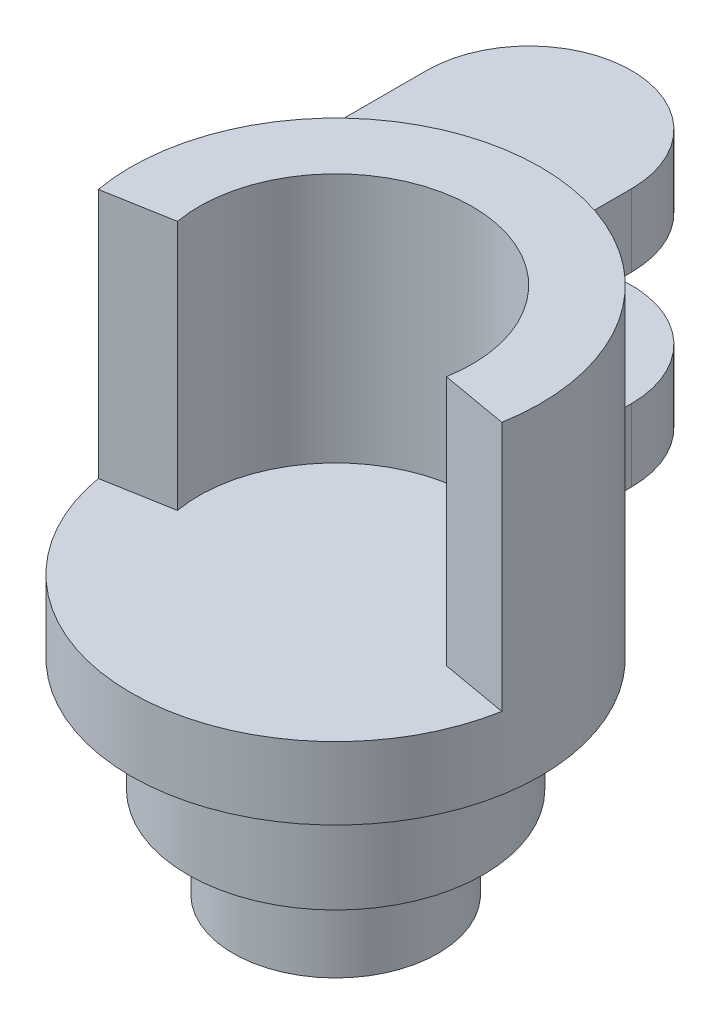
ISO-10303-21;
HEADER;
FILE_DESCRIPTION(('STEP AP214'),'2;1');
FILE_NAME('part.step','',(''),(''),'','','');
FILE_SCHEMA(('AUTOMOTIVE_DESIGN { 1 0 10303 214 1 1 1 1 }'));
ENDSEC;
DATA;
#1=APPLICATION_CONTEXT('core data for automotive mechanical design processes');
#2=APPLICATION_PROTOCOL_DEFINITION('international standard','automotive_design',2000,#1);
#3=PRODUCT_CONTEXT('',#1,'mechanical');
#4=PRODUCT('Part','Part','',(#3));
#5=PRODUCT_RELATED_PRODUCT_CATEGORY('part','',(#4));
#6=PRODUCT_DEFINITION_FORMATION('','',#4);
#7=PRODUCT_DEFINITION_CONTEXT('part definition',#1,'design');
#8=PRODUCT_DEFINITION('design','',#6,#7);
#9=PRODUCT_DEFINITION_SHAPE('','',#8);
#10=(LENGTH_UNIT() NAMED_UNIT(*) SI_UNIT(.MILLI.,.METRE.));
#11=(NAMED_UNIT(*) PLANE_ANGLE_UNIT() SI_UNIT($,.RADIAN.));
#12=(NAMED_UNIT(*) SI_UNIT($,.STERADIAN.) SOLID_ANGLE_UNIT());
#13=UNCERTAINTY_MEASURE_WITH_UNIT(LENGTH_MEASURE(1.E-05),#10,'distance_accuracy_value','');
#14=(GEOMETRIC_REPRESENTATION_CONTEXT(3) GLOBAL_UNCERTAINTY_ASSIGNED_CONTEXT((#13)) GLOBAL_UNIT_ASSIGNED_CONTEXT((#10,
#11,#12)) REPRESENTATION_CONTEXT('',''));
#15=CARTESIAN_POINT('',(0.,0.,0.));
#16=DIRECTION('',(0.,0.,1.));
#17=DIRECTION('',(1.,0.,0.));
#18=AXIS2_PLACEMENT_3D('',#15,#16,#17);
#19=CARTESIAN_POINT('',(0.,3.175,0.));
#20=DIRECTION('',(0.,-1.,0.));
#21=DIRECTION('',(0.,0.,-1.));
#22=AXIS2_PLACEMENT_3D('',#19,#20,#21);
#23=CYLINDRICAL_SURFACE('',#22,9.);
#24=DIRECTION('',(0.,-1.,0.));
#25=VECTOR('',#24,1.);
#26=CARTESIAN_POINT('',(0.,11.349999906,-9.));
#27=LINE('',#26,#25);
#28=CARTESIAN_POINT('',(0.,11.349999906,-9.));
#29=VERTEX_POINT('',#28);
#30=CARTESIAN_POINT('',(0.,8.174999906,-9.));
#31=VERTEX_POINT('',#30);
#32=EDGE_CURVE('E60',#29,#31,#27,.T.);
#33=ORIENTED_EDGE('',*,*,#32,.F.);
#34=CARTESIAN_POINT('',(0.,11.349999906,0.));
#35=DIRECTION('',(0.,-1.,0.));
#36=DIRECTION('',(0.,0.,1.));
#37=AXIS2_PLACEMENT_3D('',#34,#35,#36);
#38=CIRCLE('',#37,9.);
#39=CARTESIAN_POINT('',(-9.,11.349999906,0.));
#40=VERTEX_POINT('',#39);
#41=EDGE_CURVE('E65',#40,#29,#38,.T.);
#42=ORIENTED_EDGE('',*,*,#41,.F.);
#43=DIRECTION('',(0.,-1.,0.));
#44=VECTOR('',#43,1.);
#45=CARTESIAN_POINT('',(-9.,11.349999906,0.));
#46=LINE('',#45,#44);
#47=CARTESIAN_POINT('',(-9.,8.174999906,0.));
#48=VERTEX_POINT('',#47);
#49=EDGE_CURVE('E157',#40,#48,#46,.T.);
#50=ORIENTED_EDGE('',*,*,#49,.T.);
#51=CARTESIAN_POINT('',(0.,8.174999906,0.));
#52=DIRECTION('',(0.,-1.,0.));
#53=DIRECTION('',(0.,0.,1.));
#54=AXIS2_PLACEMENT_3D('',#51,#52,#53);
#55=CIRCLE('',#54,9.);
#56=EDGE_CURVE('E161',#48,#31,#55,.T.);
#57=ORIENTED_EDGE('',*,*,#56,.T.);
#58=EDGE_LOOP('',(#33,#42,#50,#57));
#59=FACE_BOUND('',#58,.T.);
#60=CARTESIAN_POINT('',(0.,3.175,0.));
#61=DIRECTION('',(0.,1.,0.));
#62=DIRECTION('',(0.,0.,1.));
#63=AXIS2_PLACEMENT_3D('',#60,#61,#62);
#64=CIRCLE('',#63,9.);
#65=CARTESIAN_POINT('',(-8.86326977710987,3.175,1.56283359900238));
#66=VERTEX_POINT('',#65);
#67=CARTESIAN_POINT('',(8.86326977710987,3.175,1.56283359900238));
#68=VERTEX_POINT('',#67);
#69=EDGE_CURVE('E231',#66,#68,#64,.T.);
#70=ORIENTED_EDGE('',*,*,#69,.F.);
#71=DIRECTION('',(0.,-1.,0.));
#72=VECTOR('',#71,1.);
#73=CARTESIAN_POINT('',(-8.86326977710987,14.175,1.56283359900238));
#74=LINE('',#73,#72);
#75=CARTESIAN_POINT('',(-8.86326977710987,14.175,1.56283359900238));
#76=VERTEX_POINT('',#75);
#77=EDGE_CURVE('E264',#76,#66,#74,.T.);
#78=ORIENTED_EDGE('',*,*,#77,.F.);
#79=CARTESIAN_POINT('',(0.,14.175,0.));
#80=DIRECTION('',(0.,1.,0.));
#81=DIRECTION('',(0.,0.,1.));
#82=AXIS2_PLACEMENT_3D('',#79,#80,#81);
#83=CIRCLE('',#82,9.);
#84=CARTESIAN_POINT('',(8.86326977710987,14.175,1.56283359900238));
#85=VERTEX_POINT('',#84);
#86=EDGE_CURVE('E240',#85,#76,#83,.T.);
#87=ORIENTED_EDGE('',*,*,#86,.F.);
#88=DIRECTION('',(0.,-1.,0.));
#89=VECTOR('',#88,1.);
#90=CARTESIAN_POINT('',(8.86326977710987,14.175,1.56283359900238));
#91=LINE('',#90,#89);
#92=EDGE_CURVE('E260',#85,#68,#91,.T.);
#93=ORIENTED_EDGE('',*,*,#92,.T.);
#94=EDGE_LOOP('',(#70,#78,#87,#93));
#95=FACE_BOUND('',#94,.T.);
#96=CARTESIAN_POINT('',(0.,3.175,0.));
#97=DIRECTION('',(0.,1.,0.));
#98=DIRECTION('',(0.,0.,1.));
#99=AXIS2_PLACEMENT_3D('',#96,#97,#98);
#100=CIRCLE('',#99,9.);
#101=CARTESIAN_POINT('',(0.,3.175,-9.));
#102=VERTEX_POINT('',#101);
#103=CARTESIAN_POINT('',(-9.,3.175,0.));
#104=VERTEX_POINT('',#103);
#105=EDGE_CURVE('E184',#102,#104,#100,.T.);
#106=ORIENTED_EDGE('',*,*,#105,.T.);
#107=DIRECTION('',(0.,-1.,0.));
#108=VECTOR('',#107,1.);
#109=CARTESIAN_POINT('',(-9.,22.8536686541544,0.));
#110=LINE('',#109,#108);
#111=CARTESIAN_POINT('',(-9.,0.,0.));
#112=VERTEX_POINT('',#111);
#113=EDGE_CURVE('E201',#104,#112,#110,.T.);
#114=ORIENTED_EDGE('',*,*,#113,.T.);
#115=CARTESIAN_POINT('',(0.,0.,0.));
#116=DIRECTION('',(0.,1.,0.));
#117=DIRECTION('',(0.,0.,1.));
#118=AXIS2_PLACEMENT_3D('',#115,#116,#117);
#119=CIRCLE('',#118,9.);
#120=CARTESIAN_POINT('',(0.,0.,-9.));
#121=VERTEX_POINT('',#120);
#122=EDGE_CURVE('E46',#112,#121,#119,.T.);
#123=ORIENTED_EDGE('',*,*,#122,.T.);
#124=DIRECTION('',(0.,-1.,0.));
#125=VECTOR('',#124,1.);
#126=CARTESIAN_POINT('',(0.,22.8536686541544,-9.));
#127=LINE('',#126,#125);
#128=EDGE_CURVE('E185',#102,#121,#127,.T.);
#129=ORIENTED_EDGE('',*,*,#128,.F.);
#130=EDGE_LOOP('',(#106,#114,#123,#129));
#131=FACE_BOUND('',#130,.T.);
#132=ADVANCED_FACE('F43',(#59,#95,#131),#23,.T.);
#133=CARTESIAN_POINT('',(0.,3.175,0.));
#134=DIRECTION('',(0.,1.,0.));
#135=DIRECTION('',(0.,0.,1.));
#136=AXIS2_PLACEMENT_3D('',#133,#134,#135);
#137=PLANE('',#136);
#138=DIRECTION('',(0.984807753012208,0.,-0.173648177666933));
#139=VECTOR('',#138,1.);
#140=CARTESIAN_POINT('',(-8.86326977710987,3.175,1.56283359900238));
#141=LINE('',#140,#139);
#142=CARTESIAN_POINT('',(-5.90884651807325,3.175,1.04188906600158));
#143=VERTEX_POINT('',#142);
#144=EDGE_CURVE('E249',#66,#143,#141,.T.);
#145=ORIENTED_EDGE('',*,*,#144,.F.);
#146=ORIENTED_EDGE('',*,*,#69,.T.);
#147=DIRECTION('',(0.984807753012208,0.,0.17364817766693));
#148=VECTOR('',#147,1.);
#149=CARTESIAN_POINT('',(5.90884651807325,3.175,1.04188906600159));
#150=LINE('',#149,#148);
#151=CARTESIAN_POINT('',(5.90884651807325,3.175,1.04188906600159));
#152=VERTEX_POINT('',#151);
#153=EDGE_CURVE('E237',#152,#68,#150,.T.);
#154=ORIENTED_EDGE('',*,*,#153,.F.);
#155=CARTESIAN_POINT('',(0.,3.175,0.));
#156=DIRECTION('',(0.,1.,0.));
#157=DIRECTION('',(0.,0.,1.));
#158=AXIS2_PLACEMENT_3D('',#155,#156,#157);
#159=CIRCLE('',#158,6.);
#160=EDGE_CURVE('E227',#152,#143,#159,.T.);
#161=ORIENTED_EDGE('',*,*,#160,.T.);
#162=EDGE_LOOP('',(#145,#146,#154,#161));
#163=FACE_BOUND('',#162,.T.);
#164=ADVANCED_FACE('F304',(#163),#137,.T.);
#165=CARTESIAN_POINT('',(0.,0.,0.));
#166=DIRECTION('',(0.,1.,0.));
#167=DIRECTION('',(0.,0.,1.));
#168=AXIS2_PLACEMENT_3D('',#165,#166,#167);
#169=PLANE('',#168);
#170=CARTESIAN_POINT('',(0.,0.,0.));
#171=DIRECTION('',(0.,-1.,0.));
#172=DIRECTION('',(0.,0.,-1.));
#173=AXIS2_PLACEMENT_3D('',#170,#171,#172);
#174=CIRCLE('',#173,6.5);
#175=CARTESIAN_POINT('',(0.,0.,-6.5));
#176=VERTEX_POINT('',#175);
#177=EDGE_CURVE('E52',#176,#176,#174,.T.);
#178=ORIENTED_EDGE('',*,*,#177,.F.);
#179=EDGE_LOOP('',(#178));
#180=FACE_BOUND('',#179,.T.);
#181=ORIENTED_EDGE('',*,*,#122,.F.);
#182=DIRECTION('',(0.,0.,-1.));
#183=VECTOR('',#182,1.);
#184=CARTESIAN_POINT('',(-9.,0.,0.));
#185=LINE('',#184,#183);
#186=CARTESIAN_POINT('',(-9.,0.,-13.));
#187=VERTEX_POINT('',#186);
#188=EDGE_CURVE('E191',#112,#187,#185,.T.);
#189=ORIENTED_EDGE('',*,*,#188,.T.);
#190=CARTESIAN_POINT('',(-4.5,0.,-13.));
#191=DIRECTION('',(0.,-1.,0.));
#192=DIRECTION('',(0.,0.,-1.));
#193=AXIS2_PLACEMENT_3D('',#190,#191,#192);
#194=CIRCLE('',#193,4.5);
#195=CARTESIAN_POINT('',(0.,0.,-13.));
#196=VERTEX_POINT('',#195);
#197=EDGE_CURVE('E186',#187,#196,#194,.T.);
#198=ORIENTED_EDGE('',*,*,#197,.T.);
#199=DIRECTION('',(0.,0.,-1.));
#200=VECTOR('',#199,1.);
#201=CARTESIAN_POINT('',(0.,0.,-9.));
#202=LINE('',#201,#200);
#203=EDGE_CURVE('E180',#121,#196,#202,.T.);
#204=ORIENTED_EDGE('',*,*,#203,.F.);
#205=EDGE_LOOP('',(#181,#189,#198,#204));
#206=FACE_BOUND('',#205,.T.);
#207=ADVANCED_FACE('F284',(#180,#206),#169,.F.);
#208=CARTESIAN_POINT('',(0.,14.175,0.));
#209=DIRECTION('',(0.,-1.,0.));
#210=DIRECTION('',(0.,0.,-1.));
#211=AXIS2_PLACEMENT_3D('',#208,#209,#210);
#212=CYLINDRICAL_SURFACE('',#211,6.);
#213=ORIENTED_EDGE('',*,*,#160,.F.);
#214=DIRECTION('',(0.,-1.,0.));
#215=VECTOR('',#214,1.);
#216=CARTESIAN_POINT('',(5.90884651807325,14.175,1.04188906600159));
#217=LINE('',#216,#215);
#218=CARTESIAN_POINT('',(5.90884651807325,14.175,1.04188906600159));
#219=VERTEX_POINT('',#218);
#220=EDGE_CURVE('E256',#219,#152,#217,.T.);
#221=ORIENTED_EDGE('',*,*,#220,.F.);
#222=CARTESIAN_POINT('',(0.,14.175,0.));
#223=DIRECTION('',(0.,1.,0.));
#224=DIRECTION('',(0.,0.,1.));
#225=AXIS2_PLACEMENT_3D('',#222,#223,#224);
#226=CIRCLE('',#225,6.);
#227=CARTESIAN_POINT('',(-5.90884651807325,14.175,1.04188906600158));
#228=VERTEX_POINT('',#227);
#229=EDGE_CURVE('E232',#219,#228,#226,.T.);
#230=ORIENTED_EDGE('',*,*,#229,.T.);
#231=DIRECTION('',(0.,-1.,0.));
#232=VECTOR('',#231,1.);
#233=CARTESIAN_POINT('',(-5.90884651807325,14.175,1.04188906600158));
#234=LINE('',#233,#232);
#235=EDGE_CURVE('E246',#228,#143,#234,.T.);
#236=ORIENTED_EDGE('',*,*,#235,.T.);
#237=EDGE_LOOP('',(#213,#221,#230,#236));
#238=FACE_BOUND('',#237,.T.);
#239=ADVANCED_FACE('F325',(#238),#212,.F.);
#240=CARTESIAN_POINT('',(5.90884651807325,14.175,1.04188906600159));
#241=DIRECTION('',(0.17364817766693,0.,-0.984807753012208));
#242=DIRECTION('',(-0.984807753012208,0.,-0.17364817766693));
#243=AXIS2_PLACEMENT_3D('',#240,#241,#242);
#244=PLANE('',#243);
#245=ORIENTED_EDGE('',*,*,#153,.T.);
#246=ORIENTED_EDGE('',*,*,#92,.F.);
#247=DIRECTION('',(0.984807753012208,0.,0.17364817766693));
#248=VECTOR('',#247,1.);
#249=CARTESIAN_POINT('',(5.90884651807325,14.175,1.04188906600159));
#250=LINE('',#249,#248);
#251=EDGE_CURVE('E243',#219,#85,#250,.T.);
#252=ORIENTED_EDGE('',*,*,#251,.F.);
#253=ORIENTED_EDGE('',*,*,#220,.T.);
#254=EDGE_LOOP('',(#245,#246,#252,#253));
#255=FACE_BOUND('',#254,.T.);
#256=ADVANCED_FACE('F322',(#255),#244,.F.);
#257=CARTESIAN_POINT('',(-8.86326977710987,14.175,1.56283359900238));
#258=DIRECTION('',(-0.173648177666933,0.,-0.984807753012208));
#259=DIRECTION('',(-0.984807753012208,0.,0.173648177666933));
#260=AXIS2_PLACEMENT_3D('',#257,#258,#259);
#261=PLANE('',#260);
#262=ORIENTED_EDGE('',*,*,#144,.T.);
#263=ORIENTED_EDGE('',*,*,#235,.F.);
#264=DIRECTION('',(0.984807753012208,0.,-0.173648177666933));
#265=VECTOR('',#264,1.);
#266=CARTESIAN_POINT('',(-8.86326977710987,14.175,1.56283359900238));
#267=LINE('',#266,#265);
#268=EDGE_CURVE('E236',#76,#228,#267,.T.);
#269=ORIENTED_EDGE('',*,*,#268,.F.);
#270=ORIENTED_EDGE('',*,*,#77,.T.);
#271=EDGE_LOOP('',(#262,#263,#269,#270));
#272=FACE_BOUND('',#271,.T.);
#273=ADVANCED_FACE('F315',(#272),#261,.F.);
#274=CARTESIAN_POINT('',(0.,14.175,0.));
#275=DIRECTION('',(0.,1.,0.));
#276=DIRECTION('',(0.,0.,1.));
#277=AXIS2_PLACEMENT_3D('',#274,#275,#276);
#278=PLANE('',#277);
#279=ORIENTED_EDGE('',*,*,#229,.F.);
#280=ORIENTED_EDGE('',*,*,#251,.T.);
#281=ORIENTED_EDGE('',*,*,#86,.T.);
#282=ORIENTED_EDGE('',*,*,#268,.T.);
#283=EDGE_LOOP('',(#279,#280,#281,#282));
#284=FACE_BOUND('',#283,.T.);
#285=ADVANCED_FACE('F319',(#284),#278,.T.);
#286=CARTESIAN_POINT('',(0.,-5.,0.));
#287=DIRECTION('',(0.,1.,0.));
#288=DIRECTION('',(0.,0.,1.));
#289=AXIS2_PLACEMENT_3D('',#286,#287,#288);
#290=CYLINDRICAL_SURFACE('',#289,6.5);
#291=CARTESIAN_POINT('',(0.,-5.,0.));
#292=DIRECTION('',(0.,-1.,0.));
#293=DIRECTION('',(0.,0.,-1.));
#294=AXIS2_PLACEMENT_3D('',#291,#292,#293);
#295=CIRCLE('',#294,6.5);
#296=CARTESIAN_POINT('',(0.,-5.,-6.5));
#297=VERTEX_POINT('',#296);
#298=EDGE_CURVE('E222',#297,#297,#295,.T.);
#299=ORIENTED_EDGE('',*,*,#298,.F.);
#300=EDGE_LOOP('',(#299));
#301=FACE_BOUND('',#300,.T.);
#302=ORIENTED_EDGE('',*,*,#177,.T.);
#303=EDGE_LOOP('',(#302));
#304=FACE_BOUND('',#303,.T.);
#305=ADVANCED_FACE('F339',(#301,#304),#290,.T.);
#306=CARTESIAN_POINT('',(0.,-5.,0.));
#307=DIRECTION('',(0.,-1.,0.));
#308=DIRECTION('',(0.,0.,-1.));
#309=AXIS2_PLACEMENT_3D('',#306,#307,#308);
#310=PLANE('',#309);
#311=CARTESIAN_POINT('',(0.,-5.,0.));
#312=DIRECTION('',(0.,-1.,0.));
#313=DIRECTION('',(0.,0.,-1.));
#314=AXIS2_PLACEMENT_3D('',#311,#312,#313);
#315=CIRCLE('',#314,4.5);
#316=CARTESIAN_POINT('',(0.,-5.,-4.5));
#317=VERTEX_POINT('',#316);
#318=EDGE_CURVE('E11',#317,#317,#315,.T.);
#319=ORIENTED_EDGE('',*,*,#318,.F.);
#320=EDGE_LOOP('',(#319));
#321=FACE_BOUND('',#320,.T.);
#322=ORIENTED_EDGE('',*,*,#298,.T.);
#323=EDGE_LOOP('',(#322));
#324=FACE_BOUND('',#323,.T.);
#325=ADVANCED_FACE('F342',(#321,#324),#310,.T.);
#326=CARTESIAN_POINT('',(0.,-9.,0.));
#327=DIRECTION('',(0.,1.,0.));
#328=DIRECTION('',(0.,0.,1.));
#329=AXIS2_PLACEMENT_3D('',#326,#327,#328);
#330=CYLINDRICAL_SURFACE('',#329,4.5);
#331=CARTESIAN_POINT('',(0.,-9.,0.));
#332=DIRECTION('',(0.,-1.,0.));
#333=DIRECTION('',(0.,0.,-1.));
#334=AXIS2_PLACEMENT_3D('',#331,#332,#333);
#335=CIRCLE('',#334,4.5);
#336=CARTESIAN_POINT('',(0.,-9.,-4.5));
#337=VERTEX_POINT('',#336);
#338=EDGE_CURVE('E219',#337,#337,#335,.T.);
#339=ORIENTED_EDGE('',*,*,#338,.F.);
#340=EDGE_LOOP('',(#339));
#341=FACE_BOUND('',#340,.T.);
#342=ORIENTED_EDGE('',*,*,#318,.T.);
#343=EDGE_LOOP('',(#342));
#344=FACE_BOUND('',#343,.T.);
#345=ADVANCED_FACE('F346',(#341,#344),#330,.T.);
#346=CARTESIAN_POINT('',(0.,-9.,0.));
#347=DIRECTION('',(0.,-1.,0.));
#348=DIRECTION('',(0.,0.,-1.));
#349=AXIS2_PLACEMENT_3D('',#346,#347,#348);
#350=PLANE('',#349);
#351=ORIENTED_EDGE('',*,*,#338,.T.);
#352=EDGE_LOOP('',(#351));
#353=FACE_BOUND('',#352,.T.);
#354=ADVANCED_FACE('F301',(#353),#350,.T.);
#355=CARTESIAN_POINT('',(0.,3.175,0.));
#356=DIRECTION('',(0.,1.,0.));
#357=DIRECTION('',(0.,0.,1.));
#358=AXIS2_PLACEMENT_3D('',#355,#356,#357);
#359=PLANE('',#358);
#360=ORIENTED_EDGE('',*,*,#105,.F.);
#361=DIRECTION('',(0.,0.,-1.));
#362=VECTOR('',#361,1.);
#363=CARTESIAN_POINT('',(0.,3.175,-9.));
#364=LINE('',#363,#362);
#365=CARTESIAN_POINT('',(0.,3.175,-13.));
#366=VERTEX_POINT('',#365);
#367=EDGE_CURVE('E179',#102,#366,#364,.T.);
#368=ORIENTED_EDGE('',*,*,#367,.T.);
#369=CARTESIAN_POINT('',(-4.5,3.175,-13.));
#370=DIRECTION('',(0.,1.,0.));
#371=DIRECTION('',(0.,0.,1.));
#372=AXIS2_PLACEMENT_3D('',#369,#370,#371);
#373=CIRCLE('',#372,4.5);
#374=CARTESIAN_POINT('',(-9.,3.175,-13.));
#375=VERTEX_POINT('',#374);
#376=EDGE_CURVE('E204',#375,#366,#373,.F.);
#377=ORIENTED_EDGE('',*,*,#376,.F.);
#378=DIRECTION('',(0.,0.,-1.));
#379=VECTOR('',#378,1.);
#380=CARTESIAN_POINT('',(-9.,3.175,0.));
#381=LINE('',#380,#379);
#382=EDGE_CURVE('E190',#104,#375,#381,.T.);
#383=ORIENTED_EDGE('',*,*,#382,.F.);
#384=EDGE_LOOP('',(#360,#368,#377,#383));
#385=FACE_BOUND('',#384,.T.);
#386=ADVANCED_FACE('F291',(#385),#359,.T.);
#387=CARTESIAN_POINT('',(-9.,22.8536686541544,0.));
#388=DIRECTION('',(-1.,0.,0.));
#389=DIRECTION('',(0.,0.,1.));
#390=AXIS2_PLACEMENT_3D('',#387,#388,#389);
#391=PLANE('',#390);
#392=ORIENTED_EDGE('',*,*,#113,.F.);
#393=ORIENTED_EDGE('',*,*,#382,.T.);
#394=DIRECTION('',(0.,-1.,0.));
#395=VECTOR('',#394,1.);
#396=CARTESIAN_POINT('',(-9.,22.8536686541544,-13.));
#397=LINE('',#396,#395);
#398=EDGE_CURVE('E198',#375,#187,#397,.T.);
#399=ORIENTED_EDGE('',*,*,#398,.T.);
#400=ORIENTED_EDGE('',*,*,#188,.F.);
#401=EDGE_LOOP('',(#392,#393,#399,#400));
#402=FACE_BOUND('',#401,.T.);
#403=ADVANCED_FACE('F293',(#402),#391,.T.);
#404=CARTESIAN_POINT('',(-4.5,22.8536686541544,-13.));
#405=DIRECTION('',(0.,-1.,0.));
#406=DIRECTION('',(0.,0.,-1.));
#407=AXIS2_PLACEMENT_3D('',#404,#405,#406);
#408=CYLINDRICAL_SURFACE('',#407,4.5);
#409=ORIENTED_EDGE('',*,*,#398,.F.);
#410=ORIENTED_EDGE('',*,*,#376,.T.);
#411=DIRECTION('',(0.,-1.,0.));
#412=VECTOR('',#411,1.);
#413=CARTESIAN_POINT('',(0.,22.8536686541544,-13.));
#414=LINE('',#413,#412);
#415=EDGE_CURVE('E208',#366,#196,#414,.T.);
#416=ORIENTED_EDGE('',*,*,#415,.T.);
#417=ORIENTED_EDGE('',*,*,#197,.F.);
#418=EDGE_LOOP('',(#409,#410,#416,#417));
#419=FACE_BOUND('',#418,.T.);
#420=ADVANCED_FACE('F288',(#419),#408,.T.);
#421=CARTESIAN_POINT('',(0.,22.8536686541544,-9.));
#422=DIRECTION('',(-1.,0.,0.));
#423=DIRECTION('',(0.,0.,1.));
#424=AXIS2_PLACEMENT_3D('',#421,#422,#423);
#425=PLANE('',#424);
#426=ORIENTED_EDGE('',*,*,#367,.F.);
#427=ORIENTED_EDGE('',*,*,#128,.T.);
#428=ORIENTED_EDGE('',*,*,#203,.T.);
#429=ORIENTED_EDGE('',*,*,#415,.F.);
#430=EDGE_LOOP('',(#426,#427,#428,#429));
#431=FACE_BOUND('',#430,.T.);
#432=ADVANCED_FACE('F282',(#431),#425,.F.);
#433=CARTESIAN_POINT('',(0.,11.349999906,-9.));
#434=DIRECTION('',(-1.,0.,0.));
#435=DIRECTION('',(0.,0.,1.));
#436=AXIS2_PLACEMENT_3D('',#433,#434,#435);
#437=PLANE('',#436);
#438=DIRECTION('',(0.,0.,-1.));
#439=VECTOR('',#438,1.);
#440=CARTESIAN_POINT('',(0.,8.174999906,-9.));
#441=LINE('',#440,#439);
#442=CARTESIAN_POINT('',(0.,8.174999906,-13.));
#443=VERTEX_POINT('',#442);
#444=EDGE_CURVE('E144',#31,#443,#441,.T.);
#445=ORIENTED_EDGE('',*,*,#444,.T.);
#446=DIRECTION('',(0.,-1.,0.));
#447=VECTOR('',#446,1.);
#448=CARTESIAN_POINT('',(0.,11.349999906,-13.));
#449=LINE('',#448,#447);
#450=CARTESIAN_POINT('',(0.,11.349999906,-13.));
#451=VERTEX_POINT('',#450);
#452=EDGE_CURVE('E141',#451,#443,#449,.T.);
#453=ORIENTED_EDGE('',*,*,#452,.F.);
#454=DIRECTION('',(0.,0.,-1.));
#455=VECTOR('',#454,1.);
#456=CARTESIAN_POINT('',(0.,11.349999906,-9.));
#457=LINE('',#456,#455);
#458=EDGE_CURVE('E131',#29,#451,#457,.T.);
#459=ORIENTED_EDGE('',*,*,#458,.F.);
#460=ORIENTED_EDGE('',*,*,#32,.T.);
#461=EDGE_LOOP('',(#445,#453,#459,#460));
#462=FACE_BOUND('',#461,.T.);
#463=ADVANCED_FACE('F142',(#462),#437,.F.);
#464=CARTESIAN_POINT('',(-4.5,11.349999906,-13.));
#465=DIRECTION('',(0.,-1.,0.));
#466=DIRECTION('',(0.,0.,-1.));
#467=AXIS2_PLACEMENT_3D('',#464,#465,#466);
#468=CYLINDRICAL_SURFACE('',#467,4.5);
#469=CARTESIAN_POINT('',(-4.5,8.174999906,-13.));
#470=DIRECTION('',(0.,1.,0.));
#471=DIRECTION('',(0.,0.,1.));
#472=AXIS2_PLACEMENT_3D('',#469,#470,#471);
#473=CIRCLE('',#472,4.5);
#474=CARTESIAN_POINT('',(-9.,8.174999906,-13.));
#475=VERTEX_POINT('',#474);
#476=EDGE_CURVE('E166',#443,#475,#473,.T.);
#477=ORIENTED_EDGE('',*,*,#476,.T.);
#478=DIRECTION('',(0.,-1.,0.));
#479=VECTOR('',#478,1.);
#480=CARTESIAN_POINT('',(-9.,11.349999906,-13.));
#481=LINE('',#480,#479);
#482=CARTESIAN_POINT('',(-9.,11.349999906,-13.));
#483=VERTEX_POINT('',#482);
#484=EDGE_CURVE('E148',#483,#475,#481,.T.);
#485=ORIENTED_EDGE('',*,*,#484,.F.);
#486=CARTESIAN_POINT('',(-4.5,11.349999906,-13.));
#487=DIRECTION('',(0.,1.,0.));
#488=DIRECTION('',(0.,0.,1.));
#489=AXIS2_PLACEMENT_3D('',#486,#487,#488);
#490=CIRCLE('',#489,4.5);
#491=EDGE_CURVE('E135',#451,#483,#490,.T.);
#492=ORIENTED_EDGE('',*,*,#491,.F.);
#493=ORIENTED_EDGE('',*,*,#452,.T.);
#494=EDGE_LOOP('',(#477,#485,#492,#493));
#495=FACE_BOUND('',#494,.T.);
#496=ADVANCED_FACE('F150',(#495),#468,.T.);
#497=CARTESIAN_POINT('',(-9.,11.349999906,-13.));
#498=DIRECTION('',(1.,0.,0.));
#499=DIRECTION('',(0.,0.,-1.));
#500=AXIS2_PLACEMENT_3D('',#497,#498,#499);
#501=PLANE('',#500);
#502=DIRECTION('',(0.,0.,1.));
#503=VECTOR('',#502,1.);
#504=CARTESIAN_POINT('',(-9.,8.174999906,-13.));
#505=LINE('',#504,#503);
#506=EDGE_CURVE('E169',#475,#48,#505,.T.);
#507=ORIENTED_EDGE('',*,*,#506,.T.);
#508=ORIENTED_EDGE('',*,*,#49,.F.);
#509=DIRECTION('',(0.,0.,1.));
#510=VECTOR('',#509,1.);
#511=CARTESIAN_POINT('',(-9.,11.349999906,-13.));
#512=LINE('',#511,#510);
#513=EDGE_CURVE('E154',#483,#40,#512,.T.);
#514=ORIENTED_EDGE('',*,*,#513,.F.);
#515=ORIENTED_EDGE('',*,*,#484,.T.);
#516=EDGE_LOOP('',(#507,#508,#514,#515));
#517=FACE_BOUND('',#516,.T.);
#518=ADVANCED_FACE('F418',(#517),#501,.F.);
#519=CARTESIAN_POINT('',(0.,11.349999906,0.));
#520=DIRECTION('',(0.,1.,0.));
#521=DIRECTION('',(0.,0.,1.));
#522=AXIS2_PLACEMENT_3D('',#519,#520,#521);
#523=PLANE('',#522);
#524=ORIENTED_EDGE('',*,*,#41,.T.);
#525=ORIENTED_EDGE('',*,*,#458,.T.);
#526=ORIENTED_EDGE('',*,*,#491,.T.);
#527=ORIENTED_EDGE('',*,*,#513,.T.);
#528=EDGE_LOOP('',(#524,#525,#526,#527));
#529=FACE_BOUND('',#528,.T.);
#530=ADVANCED_FACE('F133',(#529),#523,.T.);
#531=CARTESIAN_POINT('',(0.,8.174999906,0.));
#532=DIRECTION('',(0.,1.,0.));
#533=DIRECTION('',(0.,0.,1.));
#534=AXIS2_PLACEMENT_3D('',#531,#532,#533);
#535=PLANE('',#534);
#536=ORIENTED_EDGE('',*,*,#56,.F.);
#537=ORIENTED_EDGE('',*,*,#506,.F.);
#538=ORIENTED_EDGE('',*,*,#476,.F.);
#539=ORIENTED_EDGE('',*,*,#444,.F.);
#540=EDGE_LOOP('',(#536,#537,#538,#539));
#541=FACE_BOUND('',#540,.T.);
#542=ADVANCED_FACE('F438',(#541),#535,.F.);
#543=CLOSED_SHELL('',(#132,#164,#207,#239,#256,#273,#285,#305,#325,#345,#354,#386,#403,#420,
#432,#463,#496,#518,#530,#542));
#544=MANIFOLD_SOLID_BREP('B2',#543);
#545=ADVANCED_BREP_SHAPE_REPRESENTATION('',(#18,#544),#14);
#546=SHAPE_DEFINITION_REPRESENTATION(#9,#545);
ENDSEC;
END-ISO-10303-21;
